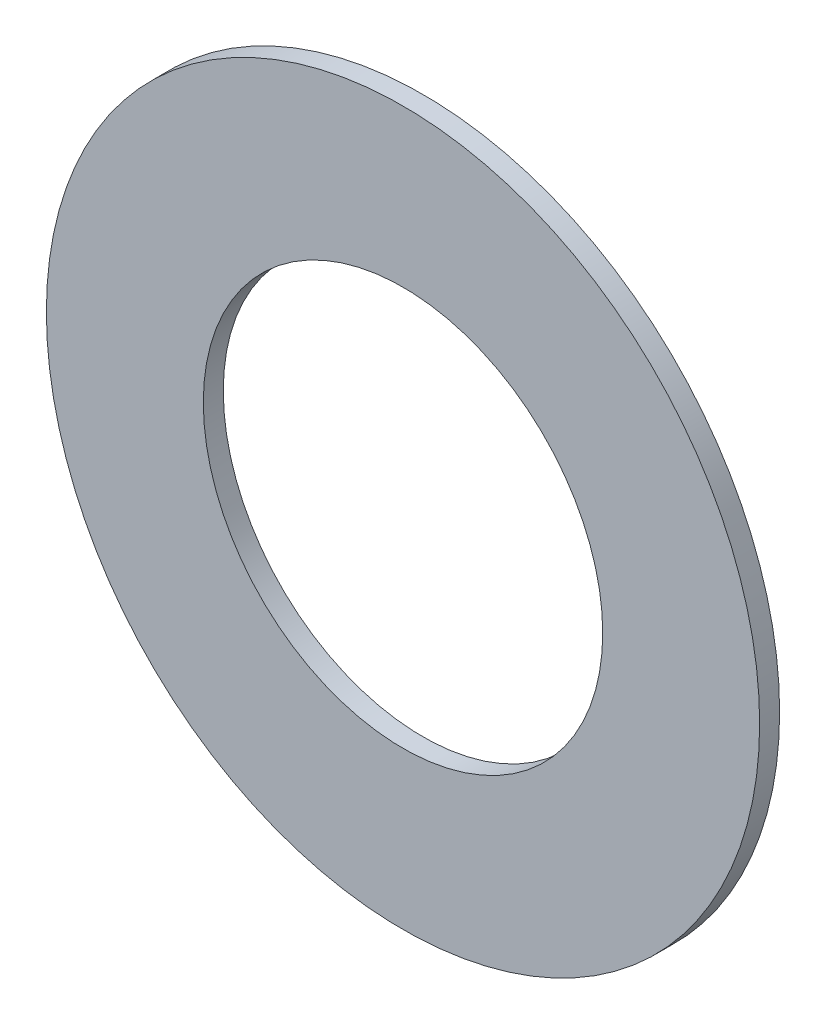
ISO-10303-21;
HEADER;
FILE_DESCRIPTION(('STEP AP214'),'2;1');
FILE_NAME('part.step','',(''),(''),'','','');
FILE_SCHEMA(('AUTOMOTIVE_DESIGN { 1 0 10303 214 1 1 1 1 }'));
ENDSEC;
DATA;
#1=APPLICATION_CONTEXT('core data for automotive mechanical design processes');
#2=APPLICATION_PROTOCOL_DEFINITION('international standard','automotive_design',2000,#1);
#3=PRODUCT_CONTEXT('',#1,'mechanical');
#4=PRODUCT('Part','Part','',(#3));
#5=PRODUCT_RELATED_PRODUCT_CATEGORY('part','',(#4));
#6=PRODUCT_DEFINITION_FORMATION('','',#4);
#7=PRODUCT_DEFINITION_CONTEXT('part definition',#1,'design');
#8=PRODUCT_DEFINITION('design','',#6,#7);
#9=PRODUCT_DEFINITION_SHAPE('','',#8);
#10=(LENGTH_UNIT() NAMED_UNIT(*) SI_UNIT(.MILLI.,.METRE.));
#11=(NAMED_UNIT(*) PLANE_ANGLE_UNIT() SI_UNIT($,.RADIAN.));
#12=(NAMED_UNIT(*) SI_UNIT($,.STERADIAN.) SOLID_ANGLE_UNIT());
#13=UNCERTAINTY_MEASURE_WITH_UNIT(LENGTH_MEASURE(1.E-05),#10,'distance_accuracy_value','');
#14=(GEOMETRIC_REPRESENTATION_CONTEXT(3) GLOBAL_UNCERTAINTY_ASSIGNED_CONTEXT((#13)) GLOBAL_UNIT_ASSIGNED_CONTEXT((#10,
#11,#12)) REPRESENTATION_CONTEXT('',''));
#15=CARTESIAN_POINT('',(0.,0.,0.));
#16=DIRECTION('',(0.,0.,1.));
#17=DIRECTION('',(1.,0.,0.));
#18=AXIS2_PLACEMENT_3D('',#15,#16,#17);
#19=CARTESIAN_POINT('',(0.,0.,0.));
#20=DIRECTION('',(0.,0.,-1.));
#21=DIRECTION('',(1.,0.,0.));
#22=AXIS2_PLACEMENT_3D('',#19,#20,#21);
#23=CYLINDRICAL_SURFACE('',#22,0.635);
#24=CARTESIAN_POINT('',(0.,0.,0.03556));
#25=DIRECTION('',(0.,0.,1.));
#26=DIRECTION('',(1.,0.,0.));
#27=AXIS2_PLACEMENT_3D('',#24,#25,#26);
#28=CIRCLE('',#27,0.635);
#29=CARTESIAN_POINT('',(0.635,0.,0.03556));
#30=VERTEX_POINT('',#29);
#31=EDGE_CURVE('E11',#30,#30,#28,.T.);
#32=ORIENTED_EDGE('',*,*,#31,.F.);
#33=DIRECTION('',(0.,0.,1.));
#34=VECTOR('',#33,1.);
#35=CARTESIAN_POINT('',(0.635,0.,0.));
#36=LINE('',#35,#34);
#37=CARTESIAN_POINT('',(0.635,0.,0.));
#38=VERTEX_POINT('',#37);
#39=EDGE_CURVE('E24',#38,#30,#36,.T.);
#40=ORIENTED_EDGE('',*,*,#39,.F.);
#41=CARTESIAN_POINT('',(0.,0.,0.));
#42=DIRECTION('',(0.,0.,1.));
#43=DIRECTION('',(1.,0.,0.));
#44=AXIS2_PLACEMENT_3D('',#41,#42,#43);
#45=CIRCLE('',#44,0.635);
#46=EDGE_CURVE('E46',#38,#38,#45,.T.);
#47=ORIENTED_EDGE('',*,*,#46,.T.);
#48=ORIENTED_EDGE('',*,*,#39,.T.);
#49=EDGE_LOOP('',(#32,#40,#47,#48));
#50=FACE_BOUND('',#49,.T.);
#51=ADVANCED_FACE('F17',(#50),#23,.T.);
#52=CARTESIAN_POINT('',(0.,0.,0.));
#53=DIRECTION('',(0.,0.,-1.));
#54=DIRECTION('',(1.,0.,0.));
#55=AXIS2_PLACEMENT_3D('',#52,#53,#54);
#56=CYLINDRICAL_SURFACE('',#55,0.3556);
#57=DIRECTION('',(0.,0.,1.));
#58=VECTOR('',#57,1.);
#59=CARTESIAN_POINT('',(0.3556,0.,0.));
#60=LINE('',#59,#58);
#61=CARTESIAN_POINT('',(0.3556,0.,0.));
#62=VERTEX_POINT('',#61);
#63=CARTESIAN_POINT('',(0.3556,0.,0.03556));
#64=VERTEX_POINT('',#63);
#65=EDGE_CURVE('E40',#62,#64,#60,.T.);
#66=ORIENTED_EDGE('',*,*,#65,.T.);
#67=CARTESIAN_POINT('',(0.,0.,0.03556));
#68=DIRECTION('',(0.,0.,1.));
#69=DIRECTION('',(1.,0.,0.));
#70=AXIS2_PLACEMENT_3D('',#67,#68,#69);
#71=CIRCLE('',#70,0.3556);
#72=EDGE_CURVE('E45',#64,#64,#71,.T.);
#73=ORIENTED_EDGE('',*,*,#72,.T.);
#74=ORIENTED_EDGE('',*,*,#65,.F.);
#75=CARTESIAN_POINT('',(0.,0.,0.));
#76=DIRECTION('',(0.,0.,1.));
#77=DIRECTION('',(1.,0.,0.));
#78=AXIS2_PLACEMENT_3D('',#75,#76,#77);
#79=CIRCLE('',#78,0.3556);
#80=EDGE_CURVE('E43',#62,#62,#79,.T.);
#81=ORIENTED_EDGE('',*,*,#80,.F.);
#82=EDGE_LOOP('',(#66,#73,#74,#81));
#83=FACE_BOUND('',#82,.T.);
#84=ADVANCED_FACE('F42',(#83),#56,.F.);
#85=CARTESIAN_POINT('',(0.635,0.,0.));
#86=DIRECTION('',(0.,0.,-1.));
#87=DIRECTION('',(-1.,0.,0.));
#88=AXIS2_PLACEMENT_3D('',#85,#86,#87);
#89=PLANE('',#88);
#90=ORIENTED_EDGE('',*,*,#46,.F.);
#91=EDGE_LOOP('',(#90));
#92=FACE_BOUND('',#91,.T.);
#93=ORIENTED_EDGE('',*,*,#80,.T.);
#94=EDGE_LOOP('',(#93));
#95=FACE_BOUND('',#94,.T.);
#96=ADVANCED_FACE('F49',(#92,#95),#89,.T.);
#97=CARTESIAN_POINT('',(0.635,0.,0.03556));
#98=DIRECTION('',(0.,0.,-1.));
#99=DIRECTION('',(-1.,0.,0.));
#100=AXIS2_PLACEMENT_3D('',#97,#98,#99);
#101=PLANE('',#100);
#102=ORIENTED_EDGE('',*,*,#31,.T.);
#103=EDGE_LOOP('',(#102));
#104=FACE_BOUND('',#103,.T.);
#105=ORIENTED_EDGE('',*,*,#72,.F.);
#106=EDGE_LOOP('',(#105));
#107=FACE_BOUND('',#106,.T.);
#108=ADVANCED_FACE('F56',(#104,#107),#101,.F.);
#109=CLOSED_SHELL('',(#51,#84,#96,#108));
#110=MANIFOLD_SOLID_BREP('B1',#109);
#111=ADVANCED_BREP_SHAPE_REPRESENTATION('',(#18,#110),#14);
#112=SHAPE_DEFINITION_REPRESENTATION(#9,#111);
ENDSEC;
END-ISO-10303-21;
